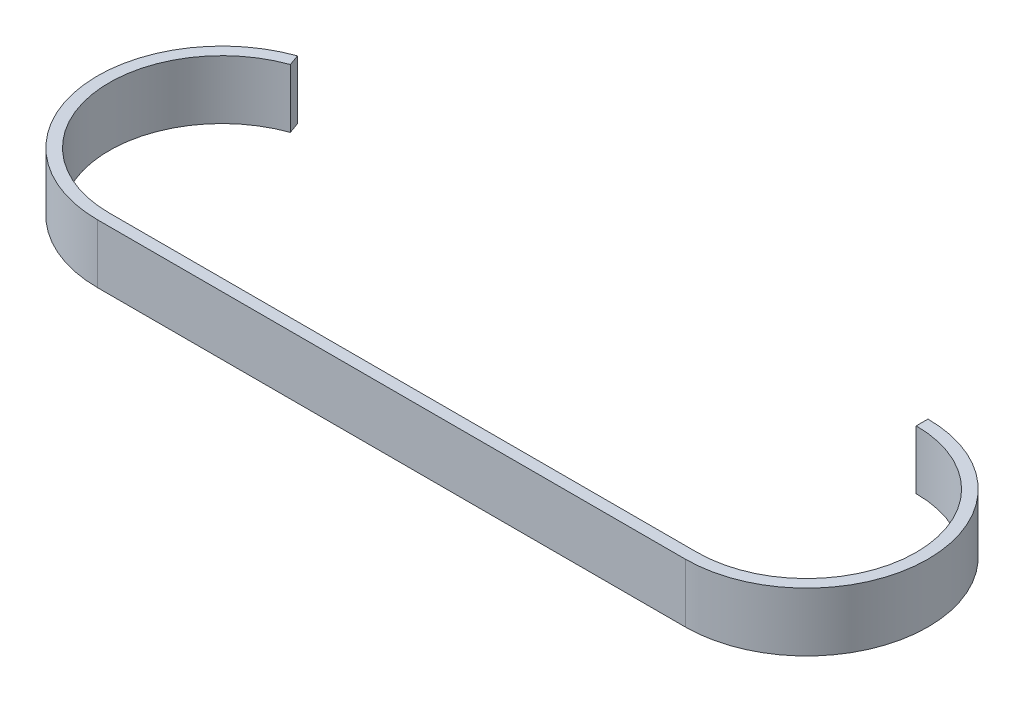
ISO-10303-21;
HEADER;
FILE_DESCRIPTION(('STEP AP214'),'2;1');
FILE_NAME('part.step','',(''),(''),'','','');
FILE_SCHEMA(('AUTOMOTIVE_DESIGN { 1 0 10303 214 1 1 1 1 }'));
ENDSEC;
DATA;
#1=APPLICATION_CONTEXT('core data for automotive mechanical design processes');
#2=APPLICATION_PROTOCOL_DEFINITION('international standard','automotive_design',2000,#1);
#3=PRODUCT_CONTEXT('',#1,'mechanical');
#4=PRODUCT('Part','Part','',(#3));
#5=PRODUCT_RELATED_PRODUCT_CATEGORY('part','',(#4));
#6=PRODUCT_DEFINITION_FORMATION('','',#4);
#7=PRODUCT_DEFINITION_CONTEXT('part definition',#1,'design');
#8=PRODUCT_DEFINITION('design','',#6,#7);
#9=PRODUCT_DEFINITION_SHAPE('','',#8);
#10=(LENGTH_UNIT() NAMED_UNIT(*) SI_UNIT(.MILLI.,.METRE.));
#11=(NAMED_UNIT(*) PLANE_ANGLE_UNIT() SI_UNIT($,.RADIAN.));
#12=(NAMED_UNIT(*) SI_UNIT($,.STERADIAN.) SOLID_ANGLE_UNIT());
#13=UNCERTAINTY_MEASURE_WITH_UNIT(LENGTH_MEASURE(1.E-05),#10,'distance_accuracy_value','');
#14=(GEOMETRIC_REPRESENTATION_CONTEXT(3) GLOBAL_UNCERTAINTY_ASSIGNED_CONTEXT((#13)) GLOBAL_UNIT_ASSIGNED_CONTEXT((#10,
#11,#12)) REPRESENTATION_CONTEXT('',''));
#15=CARTESIAN_POINT('',(0.,0.,0.));
#16=DIRECTION('',(0.,0.,1.));
#17=DIRECTION('',(1.,0.,0.));
#18=AXIS2_PLACEMENT_3D('',#15,#16,#17);
#19=CARTESIAN_POINT('',(127.,12.7,-23.6677578811731));
#20=DIRECTION('',(0.,-1.,0.));
#21=DIRECTION('',(0.,0.,-1.));
#22=AXIS2_PLACEMENT_3D('',#19,#20,#21);
#23=CYLINDRICAL_SURFACE('',#22,26.2077578811731);
#24=CARTESIAN_POINT('',(127.,0.,-23.6677578811731));
#25=DIRECTION('',(0.,1.,0.));
#26=DIRECTION('',(1.,0.,0.));
#27=AXIS2_PLACEMENT_3D('',#24,#25,#26);
#28=CIRCLE('',#27,26.2077578811731);
#29=CARTESIAN_POINT('',(127.,0.,2.54));
#30=VERTEX_POINT('',#29);
#31=CARTESIAN_POINT('',(127.,0.,-49.8755157623462));
#32=VERTEX_POINT('',#31);
#33=EDGE_CURVE('E130',#30,#32,#28,.T.);
#34=ORIENTED_EDGE('',*,*,#33,.T.);
#35=DIRECTION('',(0.,-1.,0.));
#36=VECTOR('',#35,1.);
#37=CARTESIAN_POINT('',(127.,12.7,-49.8755157623462));
#38=LINE('',#37,#36);
#39=CARTESIAN_POINT('',(127.,12.7,-49.8755157623462));
#40=VERTEX_POINT('',#39);
#41=EDGE_CURVE('E11',#40,#32,#38,.T.);
#42=ORIENTED_EDGE('',*,*,#41,.F.);
#43=CARTESIAN_POINT('',(127.,12.7,-23.6677578811731));
#44=DIRECTION('',(0.,1.,0.));
#45=DIRECTION('',(1.,0.,0.));
#46=AXIS2_PLACEMENT_3D('',#43,#44,#45);
#47=CIRCLE('',#46,26.2077578811731);
#48=CARTESIAN_POINT('',(127.,12.7,2.54));
#49=VERTEX_POINT('',#48);
#50=EDGE_CURVE('E88',#49,#40,#47,.T.);
#51=ORIENTED_EDGE('',*,*,#50,.F.);
#52=DIRECTION('',(0.,-1.,0.));
#53=VECTOR('',#52,1.);
#54=CARTESIAN_POINT('',(127.,12.7,2.54));
#55=LINE('',#54,#53);
#56=EDGE_CURVE('E129',#49,#30,#55,.T.);
#57=ORIENTED_EDGE('',*,*,#56,.T.);
#58=EDGE_LOOP('',(#34,#42,#51,#57));
#59=FACE_BOUND('',#58,.T.);
#60=ADVANCED_FACE('F33',(#59),#23,.T.);
#61=CARTESIAN_POINT('',(127.,12.7,-47.3355157623462));
#62=DIRECTION('',(-1.,0.,0.));
#63=DIRECTION('',(0.,0.,1.));
#64=AXIS2_PLACEMENT_3D('',#61,#62,#63);
#65=PLANE('',#64);
#66=DIRECTION('',(0.,0.,-1.));
#67=VECTOR('',#66,1.);
#68=CARTESIAN_POINT('',(127.,0.,-47.3355157623462));
#69=LINE('',#68,#67);
#70=CARTESIAN_POINT('',(127.,0.,-47.3355157623462));
#71=VERTEX_POINT('',#70);
#72=EDGE_CURVE('E133',#71,#32,#69,.T.);
#73=ORIENTED_EDGE('',*,*,#72,.F.);
#74=DIRECTION('',(0.,-1.,0.));
#75=VECTOR('',#74,1.);
#76=CARTESIAN_POINT('',(127.,12.7,-47.3355157623462));
#77=LINE('',#76,#75);
#78=CARTESIAN_POINT('',(127.,12.7,-47.3355157623462));
#79=VERTEX_POINT('',#78);
#80=EDGE_CURVE('E41',#79,#71,#77,.T.);
#81=ORIENTED_EDGE('',*,*,#80,.F.);
#82=DIRECTION('',(0.,0.,-1.));
#83=VECTOR('',#82,1.);
#84=CARTESIAN_POINT('',(127.,12.7,-47.3355157623462));
#85=LINE('',#84,#83);
#86=EDGE_CURVE('E172',#79,#40,#85,.T.);
#87=ORIENTED_EDGE('',*,*,#86,.T.);
#88=ORIENTED_EDGE('',*,*,#41,.T.);
#89=EDGE_LOOP('',(#73,#81,#87,#88));
#90=FACE_BOUND('',#89,.T.);
#91=ADVANCED_FACE('F163',(#90),#65,.T.);
#92=CARTESIAN_POINT('',(127.,12.7,-23.6677578811731));
#93=DIRECTION('',(0.,-1.,0.));
#94=DIRECTION('',(0.,0.,-1.));
#95=AXIS2_PLACEMENT_3D('',#92,#93,#94);
#96=CYLINDRICAL_SURFACE('',#95,23.6677578811731);
#97=CARTESIAN_POINT('',(127.,0.,-23.6677578811731));
#98=DIRECTION('',(0.,1.,0.));
#99=DIRECTION('',(0.,0.,1.));
#100=AXIS2_PLACEMENT_3D('',#97,#98,#99);
#101=CIRCLE('',#100,23.6677578811731);
#102=CARTESIAN_POINT('',(127.,0.,0.));
#103=VERTEX_POINT('',#102);
#104=EDGE_CURVE('E136',#103,#71,#101,.T.);
#105=ORIENTED_EDGE('',*,*,#104,.F.);
#106=DIRECTION('',(0.,-1.,0.));
#107=VECTOR('',#106,1.);
#108=CARTESIAN_POINT('',(127.,12.7,0.));
#109=LINE('',#108,#107);
#110=CARTESIAN_POINT('',(127.,12.7,0.));
#111=VERTEX_POINT('',#110);
#112=EDGE_CURVE('E153',#111,#103,#109,.T.);
#113=ORIENTED_EDGE('',*,*,#112,.F.);
#114=CARTESIAN_POINT('',(127.,12.7,-23.6677578811731));
#115=DIRECTION('',(0.,1.,0.));
#116=DIRECTION('',(0.,0.,1.));
#117=AXIS2_PLACEMENT_3D('',#114,#115,#116);
#118=CIRCLE('',#117,23.6677578811731);
#119=EDGE_CURVE('E160',#111,#79,#118,.T.);
#120=ORIENTED_EDGE('',*,*,#119,.T.);
#121=ORIENTED_EDGE('',*,*,#80,.T.);
#122=EDGE_LOOP('',(#105,#113,#120,#121));
#123=FACE_BOUND('',#122,.T.);
#124=ADVANCED_FACE('F158',(#123),#96,.F.);
#125=CARTESIAN_POINT('',(0.,12.7,0.));
#126=DIRECTION('',(0.,0.,-1.));
#127=DIRECTION('',(-1.,0.,0.));
#128=AXIS2_PLACEMENT_3D('',#125,#126,#127);
#129=PLANE('',#128);
#130=DIRECTION('',(1.,0.,0.));
#131=VECTOR('',#130,1.);
#132=CARTESIAN_POINT('',(0.,0.,0.));
#133=LINE('',#132,#131);
#134=CARTESIAN_POINT('',(0.,0.,0.));
#135=VERTEX_POINT('',#134);
#136=EDGE_CURVE('E139',#135,#103,#133,.T.);
#137=ORIENTED_EDGE('',*,*,#136,.F.);
#138=DIRECTION('',(0.,-1.,0.));
#139=VECTOR('',#138,1.);
#140=CARTESIAN_POINT('',(0.,12.7,0.));
#141=LINE('',#140,#139);
#142=CARTESIAN_POINT('',(0.,12.7,0.));
#143=VERTEX_POINT('',#142);
#144=EDGE_CURVE('E151',#143,#135,#141,.T.);
#145=ORIENTED_EDGE('',*,*,#144,.F.);
#146=DIRECTION('',(1.,0.,0.));
#147=VECTOR('',#146,1.);
#148=CARTESIAN_POINT('',(0.,12.7,0.));
#149=LINE('',#148,#147);
#150=EDGE_CURVE('E124',#143,#111,#149,.T.);
#151=ORIENTED_EDGE('',*,*,#150,.T.);
#152=ORIENTED_EDGE('',*,*,#112,.T.);
#153=EDGE_LOOP('',(#137,#145,#151,#152));
#154=FACE_BOUND('',#153,.T.);
#155=ADVANCED_FACE('F170',(#154),#129,.T.);
#156=CARTESIAN_POINT('',(0.,12.7,-24.3782854178501));
#157=DIRECTION('',(0.,-1.,0.));
#158=DIRECTION('',(0.,0.,-1.));
#159=AXIS2_PLACEMENT_3D('',#156,#157,#158);
#160=CYLINDRICAL_SURFACE('',#159,24.3782854178501);
#161=CARTESIAN_POINT('',(0.,0.,-24.3782854178501));
#162=DIRECTION('',(0.,1.,0.));
#163=DIRECTION('',(0.,0.,-1.));
#164=AXIS2_PLACEMENT_3D('',#161,#162,#163);
#165=CIRCLE('',#164,24.3782854178501);
#166=CARTESIAN_POINT('',(-8.20160806329519,0.,-47.3355157623462));
#167=VERTEX_POINT('',#166);
#168=EDGE_CURVE('E142',#167,#135,#165,.T.);
#169=ORIENTED_EDGE('',*,*,#168,.F.);
#170=DIRECTION('',(0.,-1.,0.));
#171=VECTOR('',#170,1.);
#172=CARTESIAN_POINT('',(-8.20160806329519,12.7,-47.3355157623462));
#173=LINE('',#172,#171);
#174=CARTESIAN_POINT('',(-8.20160806329519,12.7,-47.3355157623462));
#175=VERTEX_POINT('',#174);
#176=EDGE_CURVE('E112',#175,#167,#173,.T.);
#177=ORIENTED_EDGE('',*,*,#176,.F.);
#178=CARTESIAN_POINT('',(0.,12.7,-24.3782854178501));
#179=DIRECTION('',(0.,1.,0.));
#180=DIRECTION('',(0.,0.,-1.));
#181=AXIS2_PLACEMENT_3D('',#178,#179,#180);
#182=CIRCLE('',#181,24.3782854178501);
#183=EDGE_CURVE('E122',#175,#143,#182,.T.);
#184=ORIENTED_EDGE('',*,*,#183,.T.);
#185=ORIENTED_EDGE('',*,*,#144,.T.);
#186=EDGE_LOOP('',(#169,#177,#184,#185));
#187=FACE_BOUND('',#186,.T.);
#188=ADVANCED_FACE('F177',(#187),#160,.F.);
#189=CARTESIAN_POINT('',(-9.05614250342099,12.7,-49.7274544928824));
#190=DIRECTION('',(0.941708161628404,0.,-0.336430881939295));
#191=DIRECTION('',(-0.336430881939295,0.,-0.941708161628404));
#192=AXIS2_PLACEMENT_3D('',#189,#190,#191);
#193=PLANE('',#192);
#194=DIRECTION('',(0.336430881939295,0.,0.941708161628404));
#195=VECTOR('',#194,1.);
#196=CARTESIAN_POINT('',(-9.05614250342099,0.,-49.7274544928824));
#197=LINE('',#196,#195);
#198=CARTESIAN_POINT('',(-9.05614250342099,0.,-49.7274544928824));
#199=VERTEX_POINT('',#198);
#200=EDGE_CURVE('E111',#199,#167,#197,.T.);
#201=ORIENTED_EDGE('',*,*,#200,.F.);
#202=DIRECTION('',(0.,-1.,0.));
#203=VECTOR('',#202,1.);
#204=CARTESIAN_POINT('',(-9.05614250342099,12.7,-49.7274544928824));
#205=LINE('',#204,#203);
#206=CARTESIAN_POINT('',(-9.05614250342099,12.7,-49.7274544928824));
#207=VERTEX_POINT('',#206);
#208=EDGE_CURVE('E105',#207,#199,#205,.T.);
#209=ORIENTED_EDGE('',*,*,#208,.F.);
#210=DIRECTION('',(0.336430881939295,0.,0.941708161628404));
#211=VECTOR('',#210,1.);
#212=CARTESIAN_POINT('',(-9.05614250342099,12.7,-49.7274544928824));
#213=LINE('',#212,#211);
#214=EDGE_CURVE('E109',#207,#175,#213,.T.);
#215=ORIENTED_EDGE('',*,*,#214,.T.);
#216=ORIENTED_EDGE('',*,*,#176,.T.);
#217=EDGE_LOOP('',(#201,#209,#215,#216));
#218=FACE_BOUND('',#217,.T.);
#219=ADVANCED_FACE('F107',(#218),#193,.T.);
#220=CARTESIAN_POINT('',(0.,12.7,-24.3782854178501));
#221=DIRECTION('',(0.,-1.,0.));
#222=DIRECTION('',(0.,0.,-1.));
#223=AXIS2_PLACEMENT_3D('',#220,#221,#222);
#224=CYLINDRICAL_SURFACE('',#223,26.9182854178501);
#225=CARTESIAN_POINT('',(0.,0.,-24.3782854178501));
#226=DIRECTION('',(0.,1.,0.));
#227=DIRECTION('',(1.,0.,0.));
#228=AXIS2_PLACEMENT_3D('',#225,#226,#227);
#229=CIRCLE('',#228,26.9182854178501);
#230=CARTESIAN_POINT('',(0.,0.,2.54));
#231=VERTEX_POINT('',#230);
#232=EDGE_CURVE('E76',#199,#231,#229,.T.);
#233=ORIENTED_EDGE('',*,*,#232,.T.);
#234=DIRECTION('',(0.,-1.,0.));
#235=VECTOR('',#234,1.);
#236=CARTESIAN_POINT('',(0.,12.7,2.54));
#237=LINE('',#236,#235);
#238=CARTESIAN_POINT('',(0.,12.7,2.54));
#239=VERTEX_POINT('',#238);
#240=EDGE_CURVE('E113',#239,#231,#237,.T.);
#241=ORIENTED_EDGE('',*,*,#240,.F.);
#242=CARTESIAN_POINT('',(0.,12.7,-24.3782854178501));
#243=DIRECTION('',(0.,1.,0.));
#244=DIRECTION('',(1.,0.,0.));
#245=AXIS2_PLACEMENT_3D('',#242,#243,#244);
#246=CIRCLE('',#245,26.9182854178501);
#247=EDGE_CURVE('E115',#207,#239,#246,.T.);
#248=ORIENTED_EDGE('',*,*,#247,.F.);
#249=ORIENTED_EDGE('',*,*,#208,.T.);
#250=EDGE_LOOP('',(#233,#241,#248,#249));
#251=FACE_BOUND('',#250,.T.);
#252=ADVANCED_FACE('F116',(#251),#224,.T.);
#253=CARTESIAN_POINT('',(0.,12.7,2.54));
#254=DIRECTION('',(0.,0.,-1.));
#255=DIRECTION('',(-1.,0.,0.));
#256=AXIS2_PLACEMENT_3D('',#253,#254,#255);
#257=PLANE('',#256);
#258=DIRECTION('',(1.,0.,0.));
#259=VECTOR('',#258,1.);
#260=CARTESIAN_POINT('',(0.,0.,2.54));
#261=LINE('',#260,#259);
#262=EDGE_CURVE('E82',#231,#30,#261,.T.);
#263=ORIENTED_EDGE('',*,*,#262,.T.);
#264=ORIENTED_EDGE('',*,*,#56,.F.);
#265=DIRECTION('',(1.,0.,0.));
#266=VECTOR('',#265,1.);
#267=CARTESIAN_POINT('',(0.,12.7,2.54));
#268=LINE('',#267,#266);
#269=EDGE_CURVE('E49',#239,#49,#268,.T.);
#270=ORIENTED_EDGE('',*,*,#269,.F.);
#271=ORIENTED_EDGE('',*,*,#240,.T.);
#272=EDGE_LOOP('',(#263,#264,#270,#271));
#273=FACE_BOUND('',#272,.T.);
#274=ADVANCED_FACE('F179',(#273),#257,.F.);
#275=CARTESIAN_POINT('',(127.,12.7,-23.6677578811731));
#276=DIRECTION('',(0.,1.,0.));
#277=DIRECTION('',(1.,0.,0.));
#278=AXIS2_PLACEMENT_3D('',#275,#276,#277);
#279=PLANE('',#278);
#280=ORIENTED_EDGE('',*,*,#50,.T.);
#281=ORIENTED_EDGE('',*,*,#86,.F.);
#282=ORIENTED_EDGE('',*,*,#119,.F.);
#283=ORIENTED_EDGE('',*,*,#150,.F.);
#284=ORIENTED_EDGE('',*,*,#183,.F.);
#285=ORIENTED_EDGE('',*,*,#214,.F.);
#286=ORIENTED_EDGE('',*,*,#247,.T.);
#287=ORIENTED_EDGE('',*,*,#269,.T.);
#288=EDGE_LOOP('',(#280,#281,#282,#283,#284,#285,#286,#287));
#289=FACE_BOUND('',#288,.T.);
#290=ADVANCED_FACE('F119',(#289),#279,.T.);
#291=CARTESIAN_POINT('',(127.,0.,-23.6677578811731));
#292=DIRECTION('',(0.,1.,0.));
#293=DIRECTION('',(1.,0.,0.));
#294=AXIS2_PLACEMENT_3D('',#291,#292,#293);
#295=PLANE('',#294);
#296=ORIENTED_EDGE('',*,*,#33,.F.);
#297=ORIENTED_EDGE('',*,*,#262,.F.);
#298=ORIENTED_EDGE('',*,*,#232,.F.);
#299=ORIENTED_EDGE('',*,*,#200,.T.);
#300=ORIENTED_EDGE('',*,*,#168,.T.);
#301=ORIENTED_EDGE('',*,*,#136,.T.);
#302=ORIENTED_EDGE('',*,*,#104,.T.);
#303=ORIENTED_EDGE('',*,*,#72,.T.);
#304=EDGE_LOOP('',(#296,#297,#298,#299,#300,#301,#302,#303));
#305=FACE_BOUND('',#304,.T.);
#306=ADVANCED_FACE('F166',(#305),#295,.F.);
#307=CLOSED_SHELL('',(#60,#91,#124,#155,#188,#219,#252,#274,#290,#306));
#308=MANIFOLD_SOLID_BREP('B2',#307);
#309=ADVANCED_BREP_SHAPE_REPRESENTATION('',(#18,#308),#14);
#310=SHAPE_DEFINITION_REPRESENTATION(#9,#309);
ENDSEC;
END-ISO-10303-21;
